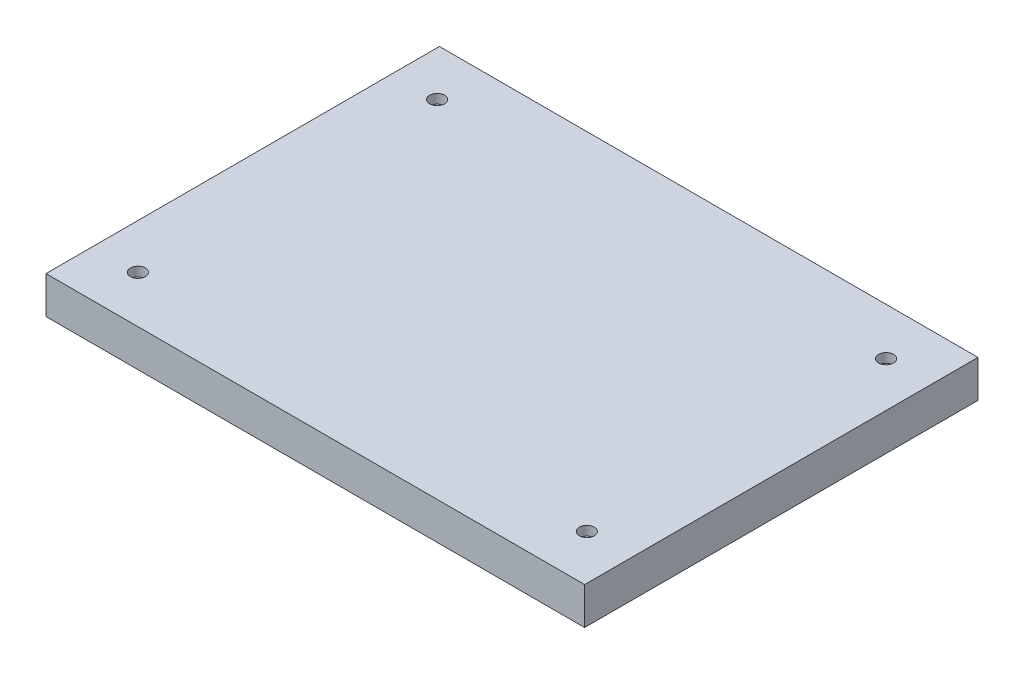
ISO-10303-21;
HEADER;
FILE_DESCRIPTION(('STEP AP214'),'2;1');
FILE_NAME('part.step','',(''),(''),'','','');
FILE_SCHEMA(('AUTOMOTIVE_DESIGN { 1 0 10303 214 1 1 1 1 }'));
ENDSEC;
DATA;
#1=APPLICATION_CONTEXT('core data for automotive mechanical design processes');
#2=APPLICATION_PROTOCOL_DEFINITION('international standard','automotive_design',2000,#1);
#3=PRODUCT_CONTEXT('',#1,'mechanical');
#4=PRODUCT('Part','Part','',(#3));
#5=PRODUCT_RELATED_PRODUCT_CATEGORY('part','',(#4));
#6=PRODUCT_DEFINITION_FORMATION('','',#4);
#7=PRODUCT_DEFINITION_CONTEXT('part definition',#1,'design');
#8=PRODUCT_DEFINITION('design','',#6,#7);
#9=PRODUCT_DEFINITION_SHAPE('','',#8);
#10=(LENGTH_UNIT() NAMED_UNIT(*) SI_UNIT(.MILLI.,.METRE.));
#11=(NAMED_UNIT(*) PLANE_ANGLE_UNIT() SI_UNIT($,.RADIAN.));
#12=(NAMED_UNIT(*) SI_UNIT($,.STERADIAN.) SOLID_ANGLE_UNIT());
#13=UNCERTAINTY_MEASURE_WITH_UNIT(LENGTH_MEASURE(1.E-05),#10,'distance_accuracy_value','');
#14=(GEOMETRIC_REPRESENTATION_CONTEXT(3) GLOBAL_UNCERTAINTY_ASSIGNED_CONTEXT((#13)) GLOBAL_UNIT_ASSIGNED_CONTEXT((#10,
#11,#12)) REPRESENTATION_CONTEXT('',''));
#15=CARTESIAN_POINT('',(0.,0.,0.));
#16=DIRECTION('',(0.,0.,1.));
#17=DIRECTION('',(1.,0.,0.));
#18=AXIS2_PLACEMENT_3D('',#15,#16,#17);
#19=CARTESIAN_POINT('',(-179.959,12.446,-131.445));
#20=DIRECTION('',(1.,0.,0.));
#21=DIRECTION('',(0.,0.,-1.));
#22=AXIS2_PLACEMENT_3D('',#19,#20,#21);
#23=PLANE('',#22);
#24=DIRECTION('',(0.,0.,1.));
#25=VECTOR('',#24,1.);
#26=CARTESIAN_POINT('',(-179.959,-12.446,-131.445));
#27=LINE('',#26,#25);
#28=CARTESIAN_POINT('',(-179.959,-12.446,-131.445));
#29=VERTEX_POINT('',#28);
#30=CARTESIAN_POINT('',(-179.959,-12.446,131.445));
#31=VERTEX_POINT('',#30);
#32=EDGE_CURVE('E98',#29,#31,#27,.T.);
#33=ORIENTED_EDGE('',*,*,#32,.T.);
#34=DIRECTION('',(0.,-1.,0.));
#35=VECTOR('',#34,1.);
#36=CARTESIAN_POINT('',(-179.959,12.446,131.445));
#37=LINE('',#36,#35);
#38=CARTESIAN_POINT('',(-179.959,12.446,131.445));
#39=VERTEX_POINT('',#38);
#40=EDGE_CURVE('E11',#39,#31,#37,.T.);
#41=ORIENTED_EDGE('',*,*,#40,.F.);
#42=DIRECTION('',(0.,0.,1.));
#43=VECTOR('',#42,1.);
#44=CARTESIAN_POINT('',(-179.959,12.446,-131.445));
#45=LINE('',#44,#43);
#46=CARTESIAN_POINT('',(-179.959,12.446,-131.445));
#47=VERTEX_POINT('',#46);
#48=EDGE_CURVE('E86',#47,#39,#45,.T.);
#49=ORIENTED_EDGE('',*,*,#48,.F.);
#50=DIRECTION('',(0.,-1.,0.));
#51=VECTOR('',#50,1.);
#52=CARTESIAN_POINT('',(-179.959,12.446,-131.445));
#53=LINE('',#52,#51);
#54=EDGE_CURVE('E94',#47,#29,#53,.T.);
#55=ORIENTED_EDGE('',*,*,#54,.T.);
#56=EDGE_LOOP('',(#33,#41,#49,#55));
#57=FACE_BOUND('',#56,.T.);
#58=ADVANCED_FACE('F35',(#57),#23,.F.);
#59=CARTESIAN_POINT('',(-179.959,12.446,131.445));
#60=DIRECTION('',(0.,0.,-1.));
#61=DIRECTION('',(-1.,0.,0.));
#62=AXIS2_PLACEMENT_3D('',#59,#60,#61);
#63=PLANE('',#62);
#64=DIRECTION('',(1.,0.,0.));
#65=VECTOR('',#64,1.);
#66=CARTESIAN_POINT('',(-179.959,-12.446,131.445));
#67=LINE('',#66,#65);
#68=CARTESIAN_POINT('',(179.959,-12.446,131.445));
#69=VERTEX_POINT('',#68);
#70=EDGE_CURVE('E90',#31,#69,#67,.T.);
#71=ORIENTED_EDGE('',*,*,#70,.T.);
#72=DIRECTION('',(0.,-1.,0.));
#73=VECTOR('',#72,1.);
#74=CARTESIAN_POINT('',(179.959,12.446,131.445));
#75=LINE('',#74,#73);
#76=CARTESIAN_POINT('',(179.959,12.446,131.445));
#77=VERTEX_POINT('',#76);
#78=EDGE_CURVE('E43',#77,#69,#75,.T.);
#79=ORIENTED_EDGE('',*,*,#78,.F.);
#80=DIRECTION('',(1.,0.,0.));
#81=VECTOR('',#80,1.);
#82=CARTESIAN_POINT('',(-179.959,12.446,131.445));
#83=LINE('',#82,#81);
#84=EDGE_CURVE('E81',#39,#77,#83,.T.);
#85=ORIENTED_EDGE('',*,*,#84,.F.);
#86=ORIENTED_EDGE('',*,*,#40,.T.);
#87=EDGE_LOOP('',(#71,#79,#85,#86));
#88=FACE_BOUND('',#87,.T.);
#89=ADVANCED_FACE('F89',(#88),#63,.F.);
#90=CARTESIAN_POINT('',(179.959,12.446,-131.445));
#91=DIRECTION('',(-1.,0.,0.));
#92=DIRECTION('',(0.,0.,1.));
#93=AXIS2_PLACEMENT_3D('',#90,#91,#92);
#94=PLANE('',#93);
#95=DIRECTION('',(0.,0.,-1.));
#96=VECTOR('',#95,1.);
#97=CARTESIAN_POINT('',(179.959,-12.446,-131.445));
#98=LINE('',#97,#96);
#99=CARTESIAN_POINT('',(179.959,-12.446,-131.445));
#100=VERTEX_POINT('',#99);
#101=EDGE_CURVE('E68',#69,#100,#98,.T.);
#102=ORIENTED_EDGE('',*,*,#101,.T.);
#103=DIRECTION('',(0.,-1.,0.));
#104=VECTOR('',#103,1.);
#105=CARTESIAN_POINT('',(179.959,12.446,-131.445));
#106=LINE('',#105,#104);
#107=CARTESIAN_POINT('',(179.959,12.446,-131.445));
#108=VERTEX_POINT('',#107);
#109=EDGE_CURVE('E91',#108,#100,#106,.T.);
#110=ORIENTED_EDGE('',*,*,#109,.F.);
#111=DIRECTION('',(0.,0.,-1.));
#112=VECTOR('',#111,1.);
#113=CARTESIAN_POINT('',(179.959,12.446,-131.445));
#114=LINE('',#113,#112);
#115=EDGE_CURVE('E84',#77,#108,#114,.T.);
#116=ORIENTED_EDGE('',*,*,#115,.F.);
#117=ORIENTED_EDGE('',*,*,#78,.T.);
#118=EDGE_LOOP('',(#102,#110,#116,#117));
#119=FACE_BOUND('',#118,.T.);
#120=ADVANCED_FACE('F92',(#119),#94,.F.);
#121=CARTESIAN_POINT('',(-179.959,12.446,-131.445));
#122=DIRECTION('',(0.,0.,1.));
#123=DIRECTION('',(1.,0.,0.));
#124=AXIS2_PLACEMENT_3D('',#121,#122,#123);
#125=PLANE('',#124);
#126=DIRECTION('',(-1.,0.,0.));
#127=VECTOR('',#126,1.);
#128=CARTESIAN_POINT('',(-179.959,-12.446,-131.445));
#129=LINE('',#128,#127);
#130=EDGE_CURVE('E74',#100,#29,#129,.T.);
#131=ORIENTED_EDGE('',*,*,#130,.T.);
#132=ORIENTED_EDGE('',*,*,#54,.F.);
#133=DIRECTION('',(-1.,0.,0.));
#134=VECTOR('',#133,1.);
#135=CARTESIAN_POINT('',(-179.959,12.446,-131.445));
#136=LINE('',#135,#134);
#137=EDGE_CURVE('E51',#108,#47,#136,.T.);
#138=ORIENTED_EDGE('',*,*,#137,.F.);
#139=ORIENTED_EDGE('',*,*,#109,.T.);
#140=EDGE_LOOP('',(#131,#132,#138,#139));
#141=FACE_BOUND('',#140,.T.);
#142=ADVANCED_FACE('F106',(#141),#125,.F.);
#143=CARTESIAN_POINT('',(0.,12.446,0.));
#144=DIRECTION('',(0.,1.,0.));
#145=DIRECTION('',(0.,0.,1.));
#146=AXIS2_PLACEMENT_3D('',#143,#144,#145);
#147=PLANE('',#146);
#148=CARTESIAN_POINT('',(-150.,12.446,100.));
#149=DIRECTION('',(0.,1.,0.));
#150=DIRECTION('',(0.,0.,1.));
#151=AXIS2_PLACEMENT_3D('',#148,#149,#150);
#152=CIRCLE('',#151,5.00000000000002);
#153=CARTESIAN_POINT('',(-150.,12.446,105.));
#154=VERTEX_POINT('',#153);
#155=EDGE_CURVE('E118',#154,#154,#152,.T.);
#156=ORIENTED_EDGE('',*,*,#155,.F.);
#157=EDGE_LOOP('',(#156));
#158=FACE_BOUND('',#157,.T.);
#159=CARTESIAN_POINT('',(150.,12.446,100.));
#160=DIRECTION('',(0.,1.,0.));
#161=DIRECTION('',(0.,0.,1.));
#162=AXIS2_PLACEMENT_3D('',#159,#160,#161);
#163=CIRCLE('',#162,4.99999999999999);
#164=CARTESIAN_POINT('',(150.,12.446,105.));
#165=VERTEX_POINT('',#164);
#166=EDGE_CURVE('E124',#165,#165,#163,.T.);
#167=ORIENTED_EDGE('',*,*,#166,.F.);
#168=EDGE_LOOP('',(#167));
#169=FACE_BOUND('',#168,.T.);
#170=CARTESIAN_POINT('',(150.,12.446,-100.));
#171=DIRECTION('',(0.,1.,0.));
#172=DIRECTION('',(0.,0.,1.));
#173=AXIS2_PLACEMENT_3D('',#170,#171,#172);
#174=CIRCLE('',#173,5.00000000000002);
#175=CARTESIAN_POINT('',(150.,12.446,-95.));
#176=VERTEX_POINT('',#175);
#177=EDGE_CURVE('E130',#176,#176,#174,.T.);
#178=ORIENTED_EDGE('',*,*,#177,.F.);
#179=EDGE_LOOP('',(#178));
#180=FACE_BOUND('',#179,.T.);
#181=CARTESIAN_POINT('',(-150.,12.446,-100.));
#182=DIRECTION('',(0.,1.,0.));
#183=DIRECTION('',(0.,0.,1.));
#184=AXIS2_PLACEMENT_3D('',#181,#182,#183);
#185=CIRCLE('',#184,5.00000000000002);
#186=CARTESIAN_POINT('',(-150.,12.446,-95.));
#187=VERTEX_POINT('',#186);
#188=EDGE_CURVE('E112',#187,#187,#185,.T.);
#189=ORIENTED_EDGE('',*,*,#188,.F.);
#190=EDGE_LOOP('',(#189));
#191=FACE_BOUND('',#190,.T.);
#192=ORIENTED_EDGE('',*,*,#48,.T.);
#193=ORIENTED_EDGE('',*,*,#84,.T.);
#194=ORIENTED_EDGE('',*,*,#115,.T.);
#195=ORIENTED_EDGE('',*,*,#137,.T.);
#196=EDGE_LOOP('',(#192,#193,#194,#195));
#197=FACE_BOUND('',#196,.T.);
#198=ADVANCED_FACE('F82',(#158,#169,#180,#191,#197),#147,.T.);
#199=CARTESIAN_POINT('',(0.,-12.446,0.));
#200=DIRECTION('',(0.,1.,0.));
#201=DIRECTION('',(0.,0.,1.));
#202=AXIS2_PLACEMENT_3D('',#199,#200,#201);
#203=PLANE('',#202);
#204=ORIENTED_EDGE('',*,*,#32,.F.);
#205=ORIENTED_EDGE('',*,*,#130,.F.);
#206=ORIENTED_EDGE('',*,*,#101,.F.);
#207=ORIENTED_EDGE('',*,*,#70,.F.);
#208=EDGE_LOOP('',(#204,#205,#206,#207));
#209=FACE_BOUND('',#208,.T.);
#210=ADVANCED_FACE('F109',(#209),#203,.F.);
#211=CARTESIAN_POINT('',(-150.,6.223,-100.));
#212=DIRECTION('',(0.,1.,0.));
#213=DIRECTION('',(0.,0.,1.));
#214=AXIS2_PLACEMENT_3D('',#211,#212,#213);
#215=CYLINDRICAL_SURFACE('',#214,5.00000000000002);
#216=CARTESIAN_POINT('',(-150.,6.223,-100.));
#217=DIRECTION('',(0.,1.,0.));
#218=DIRECTION('',(0.,0.,1.));
#219=AXIS2_PLACEMENT_3D('',#216,#217,#218);
#220=CIRCLE('',#219,5.00000000000002);
#221=CARTESIAN_POINT('',(-150.,6.223,-95.));
#222=VERTEX_POINT('',#221);
#223=EDGE_CURVE('E101',#222,#222,#220,.T.);
#224=ORIENTED_EDGE('',*,*,#223,.F.);
#225=EDGE_LOOP('',(#224));
#226=FACE_BOUND('',#225,.T.);
#227=ORIENTED_EDGE('',*,*,#188,.T.);
#228=EDGE_LOOP('',(#227));
#229=FACE_BOUND('',#228,.T.);
#230=ADVANCED_FACE('F151',(#226,#229),#215,.F.);
#231=CARTESIAN_POINT('',(-150.,6.223,-100.));
#232=DIRECTION('',(0.,1.,0.));
#233=DIRECTION('',(0.,0.,1.));
#234=AXIS2_PLACEMENT_3D('',#231,#232,#233);
#235=PLANE('',#234);
#236=ORIENTED_EDGE('',*,*,#223,.T.);
#237=EDGE_LOOP('',(#236));
#238=FACE_BOUND('',#237,.T.);
#239=ADVANCED_FACE('F141',(#238),#235,.T.);
#240=CARTESIAN_POINT('',(150.,6.223,-100.));
#241=DIRECTION('',(0.,1.,0.));
#242=DIRECTION('',(0.,0.,1.));
#243=AXIS2_PLACEMENT_3D('',#240,#241,#242);
#244=CYLINDRICAL_SURFACE('',#243,5.00000000000002);
#245=CARTESIAN_POINT('',(150.,6.223,-100.));
#246=DIRECTION('',(0.,1.,0.));
#247=DIRECTION('',(0.,0.,1.));
#248=AXIS2_PLACEMENT_3D('',#245,#246,#247);
#249=CIRCLE('',#248,5.00000000000002);
#250=CARTESIAN_POINT('',(150.,6.223,-95.));
#251=VERTEX_POINT('',#250);
#252=EDGE_CURVE('E115',#251,#251,#249,.T.);
#253=ORIENTED_EDGE('',*,*,#252,.F.);
#254=EDGE_LOOP('',(#253));
#255=FACE_BOUND('',#254,.T.);
#256=ORIENTED_EDGE('',*,*,#177,.T.);
#257=EDGE_LOOP('',(#256));
#258=FACE_BOUND('',#257,.T.);
#259=ADVANCED_FACE('F138',(#255,#258),#244,.F.);
#260=CARTESIAN_POINT('',(150.,6.223,-100.));
#261=DIRECTION('',(0.,1.,0.));
#262=DIRECTION('',(0.,0.,1.));
#263=AXIS2_PLACEMENT_3D('',#260,#261,#262);
#264=PLANE('',#263);
#265=ORIENTED_EDGE('',*,*,#252,.T.);
#266=EDGE_LOOP('',(#265));
#267=FACE_BOUND('',#266,.T.);
#268=ADVANCED_FACE('F136',(#267),#264,.T.);
#269=CARTESIAN_POINT('',(150.,6.223,100.));
#270=DIRECTION('',(0.,1.,0.));
#271=DIRECTION('',(0.,0.,1.));
#272=AXIS2_PLACEMENT_3D('',#269,#270,#271);
#273=CYLINDRICAL_SURFACE('',#272,4.99999999999999);
#274=CARTESIAN_POINT('',(150.,6.223,100.));
#275=DIRECTION('',(0.,1.,0.));
#276=DIRECTION('',(0.,0.,1.));
#277=AXIS2_PLACEMENT_3D('',#274,#275,#276);
#278=CIRCLE('',#277,4.99999999999999);
#279=CARTESIAN_POINT('',(150.,6.223,105.));
#280=VERTEX_POINT('',#279);
#281=EDGE_CURVE('E127',#280,#280,#278,.T.);
#282=ORIENTED_EDGE('',*,*,#281,.F.);
#283=EDGE_LOOP('',(#282));
#284=FACE_BOUND('',#283,.T.);
#285=ORIENTED_EDGE('',*,*,#166,.T.);
#286=EDGE_LOOP('',(#285));
#287=FACE_BOUND('',#286,.T.);
#288=ADVANCED_FACE('F226',(#284,#287),#273,.F.);
#289=CARTESIAN_POINT('',(150.,6.223,100.));
#290=DIRECTION('',(0.,1.,0.));
#291=DIRECTION('',(0.,0.,1.));
#292=AXIS2_PLACEMENT_3D('',#289,#290,#291);
#293=PLANE('',#292);
#294=ORIENTED_EDGE('',*,*,#281,.T.);
#295=EDGE_LOOP('',(#294));
#296=FACE_BOUND('',#295,.T.);
#297=ADVANCED_FACE('F235',(#296),#293,.T.);
#298=CARTESIAN_POINT('',(-150.,6.223,100.));
#299=DIRECTION('',(0.,1.,0.));
#300=DIRECTION('',(0.,0.,1.));
#301=AXIS2_PLACEMENT_3D('',#298,#299,#300);
#302=CYLINDRICAL_SURFACE('',#301,5.00000000000002);
#303=CARTESIAN_POINT('',(-150.,6.223,100.));
#304=DIRECTION('',(0.,1.,0.));
#305=DIRECTION('',(0.,0.,1.));
#306=AXIS2_PLACEMENT_3D('',#303,#304,#305);
#307=CIRCLE('',#306,5.00000000000002);
#308=CARTESIAN_POINT('',(-150.,6.223,105.));
#309=VERTEX_POINT('',#308);
#310=EDGE_CURVE('E121',#309,#309,#307,.T.);
#311=ORIENTED_EDGE('',*,*,#310,.F.);
#312=EDGE_LOOP('',(#311));
#313=FACE_BOUND('',#312,.T.);
#314=ORIENTED_EDGE('',*,*,#155,.T.);
#315=EDGE_LOOP('',(#314));
#316=FACE_BOUND('',#315,.T.);
#317=ADVANCED_FACE('F246',(#313,#316),#302,.F.);
#318=CARTESIAN_POINT('',(-150.,6.223,100.));
#319=DIRECTION('',(0.,1.,0.));
#320=DIRECTION('',(0.,0.,1.));
#321=AXIS2_PLACEMENT_3D('',#318,#319,#320);
#322=PLANE('',#321);
#323=ORIENTED_EDGE('',*,*,#310,.T.);
#324=EDGE_LOOP('',(#323));
#325=FACE_BOUND('',#324,.T.);
#326=ADVANCED_FACE('F257',(#325),#322,.T.);
#327=CLOSED_SHELL('',(#58,#89,#120,#142,#198,#210,#230,#239,#259,#268,#288,#297,#317,#326));
#328=MANIFOLD_SOLID_BREP('B2',#327);
#329=ADVANCED_BREP_SHAPE_REPRESENTATION('',(#18,#328),#14);
#330=SHAPE_DEFINITION_REPRESENTATION(#9,#329);
ENDSEC;
END-ISO-10303-21;
